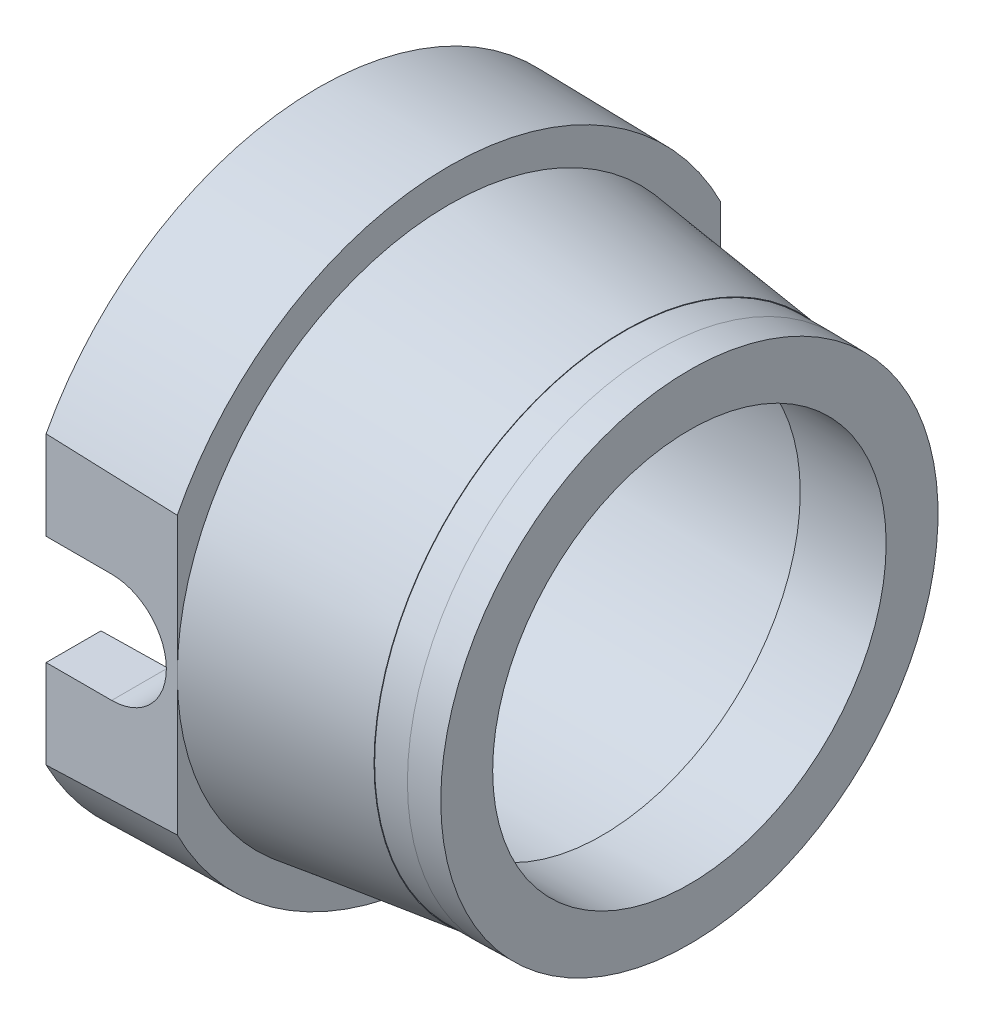
ISO-10303-21;
HEADER;
FILE_DESCRIPTION(('STEP AP214'),'2;1');
FILE_NAME('part.step','',(''),(''),'','','');
FILE_SCHEMA(('AUTOMOTIVE_DESIGN { 1 0 10303 214 1 1 1 1 }'));
ENDSEC;
DATA;
#1=APPLICATION_CONTEXT('core data for automotive mechanical design processes');
#2=APPLICATION_PROTOCOL_DEFINITION('international standard','automotive_design',2000,#1);
#3=PRODUCT_CONTEXT('',#1,'mechanical');
#4=PRODUCT('Part','Part','',(#3));
#5=PRODUCT_RELATED_PRODUCT_CATEGORY('part','',(#4));
#6=PRODUCT_DEFINITION_FORMATION('','',#4);
#7=PRODUCT_DEFINITION_CONTEXT('part definition',#1,'design');
#8=PRODUCT_DEFINITION('design','',#6,#7);
#9=PRODUCT_DEFINITION_SHAPE('','',#8);
#10=(LENGTH_UNIT() NAMED_UNIT(*) SI_UNIT(.MILLI.,.METRE.));
#11=(NAMED_UNIT(*) PLANE_ANGLE_UNIT() SI_UNIT($,.RADIAN.));
#12=(NAMED_UNIT(*) SI_UNIT($,.STERADIAN.) SOLID_ANGLE_UNIT());
#13=UNCERTAINTY_MEASURE_WITH_UNIT(LENGTH_MEASURE(1.E-05),#10,'distance_accuracy_value','');
#14=(GEOMETRIC_REPRESENTATION_CONTEXT(3) GLOBAL_UNCERTAINTY_ASSIGNED_CONTEXT((#13)) GLOBAL_UNIT_ASSIGNED_CONTEXT((#10,
#11,#12)) REPRESENTATION_CONTEXT('',''));
#15=CARTESIAN_POINT('',(0.,0.,0.));
#16=DIRECTION('',(0.,0.,1.));
#17=DIRECTION('',(1.,0.,0.));
#18=AXIS2_PLACEMENT_3D('',#15,#16,#17);
#19=CARTESIAN_POINT('',(0.,0.,0.));
#20=DIRECTION('',(-1.,0.,0.));
#21=DIRECTION('',(0.,0.,1.));
#22=AXIS2_PLACEMENT_3D('',#19,#20,#21);
#23=CONICAL_SURFACE('',#22,7.02618259743537,0.0174532925486288);
#24=CARTESIAN_POINT('',(-12.1872676926707,-3.71415595830881,6.21344466334053));
#25=CARTESIAN_POINT('',(-9.89562583112762,-3.63613958595245,6.21344466334053));
#26=CARTESIAN_POINT('',(-7.60404013963435,-3.55642084850198,6.21344466334053));
#27=CARTESIAN_POINT('',(-3.02104216778577,-3.39254531251143,6.21344466334053));
#28=CARTESIAN_POINT('',(-0.729629886433391,-3.30838854179676,6.21344466334053));
#29=CARTESIAN_POINT('',(3.85299535221891,-3.13460241250244,6.21344466334053));
#30=CARTESIAN_POINT('',(6.14420830894196,-3.04497303857963,6.21344466334053));
#31=CARTESIAN_POINT('',(9.58081722448607,-2.90517683479167,6.21344466334053));
#32=CARTESIAN_POINT('',(10.7263220416108,-2.85768591876728,6.21344466334053));
#33=CARTESIAN_POINT('',(13.0172439594786,-2.76061236810268,6.21344466334053));
#34=CARTESIAN_POINT('',(14.1626610601437,-2.71102973162117,6.21344466334053));
#35=CARTESIAN_POINT('',(15.3080257226916,-2.66024740322928,6.21344466334053));
#36=B_SPLINE_CURVE_WITH_KNOTS('',3,(#24,#25,#26,#27,#28,#29,#30,#31,#32,#33,#34,#35),
.UNSPECIFIED.,.F.,.F.,(4,2,2,2,2,4),(0.,6.87891030293197,13.7577774818794,20.6366639475237,
24.076128792137,27.5155966645013),.UNSPECIFIED.);
#37=CARTESIAN_POINT('',(0.,-3.28029683231696,6.21344466334053));
#38=VERTEX_POINT('',#37);
#39=CARTESIAN_POINT('',(3.,-3.16658089742208,6.21344466334053));
#40=VERTEX_POINT('',#39);
#41=EDGE_CURVE('E187',#38,#40,#36,.T.);
#42=ORIENTED_EDGE('',*,*,#41,.F.);
#43=CARTESIAN_POINT('',(0.,0.,0.));
#44=DIRECTION('',(-1.,0.,0.));
#45=DIRECTION('',(0.,0.,1.));
#46=AXIS2_PLACEMENT_3D('',#43,#44,#45);
#47=CIRCLE('',#46,7.02618259743537);
#48=CARTESIAN_POINT('',(0.,-3.28029683231696,-6.21344466334053));
#49=VERTEX_POINT('',#48);
#50=EDGE_CURVE('E144',#49,#38,#47,.T.);
#51=ORIENTED_EDGE('',*,*,#50,.F.);
#52=CARTESIAN_POINT('',(15.2414187475127,-2.66319994959127,-6.21344466334053));
#53=CARTESIAN_POINT('',(14.0958549741051,-2.71394359523572,-6.21344466334053));
#54=CARTESIAN_POINT('',(12.950238961195,-2.76349102414679,-6.21344466334053));
#55=CARTESIAN_POINT('',(10.6589195261381,-2.86049979818555,-6.21344466334053));
#56=CARTESIAN_POINT('',(9.51321610406869,-2.90796114513727,-6.21344466334053));
#57=CARTESIAN_POINT('',(6.07601165501921,-3.04767513380552,-6.21344466334053));
#58=CARTESIAN_POINT('',(3.78440211553146,-3.13725835039602,-6.21344466334053));
#59=CARTESIAN_POINT('',(-0.799015776381931,-3.31096342266905,-6.21344466334053));
#60=CARTESIAN_POINT('',(-3.09082412823569,-3.39508529357142,-6.21344466334053));
#61=CARTESIAN_POINT('',(-7.67461379683191,-3.55889915276708,-6.21344466334053));
#62=CARTESIAN_POINT('',(-9.96659511456438,-3.63859111341648,-6.21344466334053));
#63=CARTESIAN_POINT('',(-12.2586324979751,-3.71658320660326,-6.21344466334053));
#64=B_SPLINE_CURVE_WITH_KNOTS('',3,(#52,#53,#54,#55,#56,#57,#58,#59,#60,#61,#62,#63),
.UNSPECIFIED.,.F.,.F.,(4,2,2,2,2,4),(0.,3.44005949276843,6.88011597756067,13.7601859172206,
20.6402366824876,27.520330376414),.UNSPECIFIED.);
#65=CARTESIAN_POINT('',(3.,-3.16658089742208,-6.21344466334053));
#66=VERTEX_POINT('',#65);
#67=EDGE_CURVE('E197',#66,#49,#64,.T.);
#68=ORIENTED_EDGE('',*,*,#67,.F.);
#69=CARTESIAN_POINT('',(3.,0.,0.));
#70=DIRECTION('',(-1.,0.,0.));
#71=DIRECTION('',(0.,0.,1.));
#72=AXIS2_PLACEMENT_3D('',#69,#70,#71);
#73=CIRCLE('',#72,6.97381740256463);
#74=EDGE_CURVE('E176',#66,#40,#73,.T.);
#75=ORIENTED_EDGE('',*,*,#74,.T.);
#76=EDGE_LOOP('',(#42,#51,#68,#75));
#77=FACE_BOUND('',#76,.T.);
#78=ADVANCED_FACE('F49',(#77),#23,.T.);
#79=CARTESIAN_POINT('',(3.,0.,0.));
#80=DIRECTION('',(-1.,0.,0.));
#81=DIRECTION('',(0.,0.,1.));
#82=AXIS2_PLACEMENT_3D('',#79,#80,#81);
#83=PLANE('',#82);
#84=CARTESIAN_POINT('',(3.,3.16658089742208,6.21344466334053));
#85=VERTEX_POINT('',#84);
#86=CARTESIAN_POINT('',(3.,3.16658089742208,-6.21344466334053));
#87=VERTEX_POINT('',#86);
#88=EDGE_CURVE('E175',#85,#87,#73,.T.);
#89=ORIENTED_EDGE('',*,*,#88,.F.);
#90=DIRECTION('',(0.,1.,0.));
#91=VECTOR('',#90,1.);
#92=CARTESIAN_POINT('',(3.,5.95032536714044,6.21344466334053));
#93=LINE('',#92,#91);
#94=CARTESIAN_POINT('',(3.,0.,6.21344466334053));
#95=VERTEX_POINT('',#94);
#96=EDGE_CURVE('E352',#95,#85,#93,.T.);
#97=ORIENTED_EDGE('',*,*,#96,.F.);
#98=CARTESIAN_POINT('',(3.,0.,0.));
#99=DIRECTION('',(-1.,0.,0.));
#100=DIRECTION('',(0.,0.,1.));
#101=AXIS2_PLACEMENT_3D('',#98,#99,#100);
#102=CIRCLE('',#101,6.21344466334053);
#103=CARTESIAN_POINT('',(3.,0.,-6.21344466334053));
#104=VERTEX_POINT('',#103);
#105=EDGE_CURVE('E171',#95,#104,#102,.T.);
#106=ORIENTED_EDGE('',*,*,#105,.T.);
#107=DIRECTION('',(0.,-1.,0.));
#108=VECTOR('',#107,1.);
#109=CARTESIAN_POINT('',(3.,5.95032536714044,-6.21344466334053));
#110=LINE('',#109,#108);
#111=EDGE_CURVE('E199',#87,#104,#110,.T.);
#112=ORIENTED_EDGE('',*,*,#111,.F.);
#113=EDGE_LOOP('',(#89,#97,#106,#112));
#114=FACE_BOUND('',#113,.T.);
#115=ADVANCED_FACE('F252',(#114),#83,.F.);
#116=CARTESIAN_POINT('',(15.215736413473,2.66433765465463,6.21344466334053));
#117=CARTESIAN_POINT('',(14.070095868978,2.71506642254333,6.21344466334053));
#118=CARTESIAN_POINT('',(12.9244031612454,2.76460030895749,6.21344466334053));
#119=CARTESIAN_POINT('',(10.6329304545743,2.86158416491953,6.21344466334053));
#120=CARTESIAN_POINT('',(9.48715045571292,2.90903413628481,6.21344466334053));
#121=CARTESIAN_POINT('',(6.04971638440036,3.04871649396895,6.21344466334053));
#122=CARTESIAN_POINT('',(3.75795393230507,3.13828194963874,6.21344466334053));
#123=CARTESIAN_POINT('',(-0.825769587859922,3.31195582973247,6.21344466334053));
#124=CARTESIAN_POINT('',(-3.11773065535965,3.39606426932899,6.21344466334053));
#125=CARTESIAN_POINT('',(-7.70182558445647,3.55985439070571,6.21344466334053));
#126=CARTESIAN_POINT('',(-9.99395944704085,3.63953604491158,6.21344466334053));
#127=CARTESIAN_POINT('',(-12.2861493351395,3.71751879300665,6.21344466334053));
#128=B_SPLINE_CURVE_WITH_KNOTS('',3,(#116,#117,#118,#119,#120,#121,#122,#123,#124,#125,#126,
#127),.UNSPECIFIED.,.F.,.F.,(4,2,2,2,2,4),(0.,3.44028761006639,6.88057221973697,
13.7610984835044,20.6416056159538,27.5221556020752),.UNSPECIFIED.);
#129=CARTESIAN_POINT('',(0.,3.28029683231696,6.21344466334053));
#130=VERTEX_POINT('',#129);
#131=EDGE_CURVE('E72',#85,#130,#128,.T.);
#132=ORIENTED_EDGE('',*,*,#131,.F.);
#133=ORIENTED_EDGE('',*,*,#88,.T.);
#134=CARTESIAN_POINT('',(-12.1732282757239,3.71367831435299,-6.21344466334053));
#135=CARTESIAN_POINT('',(-9.88166422446232,3.63565715834759,-6.21344466334053));
#136=CARTESIAN_POINT('',(-7.59015636381853,3.55593314515168,-6.21344466334053));
#137=CARTESIAN_POINT('',(-3.00731414129191,3.39204545643078,-6.21344466334053));
#138=CARTESIAN_POINT('',(-0.715979778410619,3.30788180876708,-6.21344466334053));
#139=CARTESIAN_POINT('',(3.86648952227814,3.13407970604902,-6.21344466334053));
#140=CARTESIAN_POINT('',(6.15762445950775,3.04444123562709,-6.21344466334053));
#141=CARTESIAN_POINT('',(9.59411621570703,2.90462882716021,-6.21344466334053));
#142=CARTESIAN_POINT('',(10.739581961215,2.85713208275401,-6.21344466334053));
#143=CARTESIAN_POINT('',(13.0304256751926,2.76004576290605,-6.21344466334053));
#144=CARTESIAN_POINT('',(14.1758036435839,2.71045618561957,-6.21344466334053));
#145=CARTESIAN_POINT('',(15.3211291346448,2.65966623068114,-6.21344466334053));
#146=B_SPLINE_CURVE_WITH_KNOTS('',3,(#134,#135,#136,#137,#138,#139,#140,#141,#142,#143,#144,
#145),.UNSPECIFIED.,.F.,.F.,(4,2,2,2,2,4),(0.,6.87867749758971,13.7573118326248,
20.6359654765506,24.0753139294242,27.5146654139589),.UNSPECIFIED.);
#147=CARTESIAN_POINT('',(0.,3.28029683231696,-6.21344466334053));
#148=VERTEX_POINT('',#147);
#149=EDGE_CURVE('E198',#148,#87,#146,.T.);
#150=ORIENTED_EDGE('',*,*,#149,.F.);
#151=EDGE_CURVE('E150',#130,#148,#47,.T.);
#152=ORIENTED_EDGE('',*,*,#151,.F.);
#153=EDGE_LOOP('',(#132,#133,#150,#152));
#154=FACE_BOUND('',#153,.T.);
#155=ADVANCED_FACE('F51',(#154),#23,.T.);
#156=EDGE_CURVE('E172',#104,#95,#102,.T.);
#157=ORIENTED_EDGE('',*,*,#156,.T.);
#158=EDGE_CURVE('E354',#40,#95,#93,.T.);
#159=ORIENTED_EDGE('',*,*,#158,.F.);
#160=ORIENTED_EDGE('',*,*,#74,.F.);
#161=EDGE_CURVE('E193',#104,#66,#110,.T.);
#162=ORIENTED_EDGE('',*,*,#161,.F.);
#163=EDGE_LOOP('',(#157,#159,#160,#162));
#164=FACE_BOUND('',#163,.T.);
#165=ADVANCED_FACE('F248',(#164),#83,.F.);
#166=CARTESIAN_POINT('',(7.00000000000001,0.,0.));
#167=DIRECTION('',(-1.,0.,0.));
#168=DIRECTION('',(0.,0.,1.));
#169=AXIS2_PLACEMENT_3D('',#166,#167,#168);
#170=CONICAL_SURFACE('',#169,5.7130912986959,0.124441975667188);
#171=ORIENTED_EDGE('',*,*,#156,.F.);
#172=ORIENTED_EDGE('',*,*,#105,.F.);
#173=EDGE_LOOP('',(#171,#172));
#174=FACE_BOUND('',#173,.T.);
#175=CARTESIAN_POINT('',(7.00000000000001,0.,0.));
#176=DIRECTION('',(-1.,0.,0.));
#177=DIRECTION('',(0.,0.,1.));
#178=AXIS2_PLACEMENT_3D('',#175,#176,#177);
#179=CIRCLE('',#178,5.7130912986959);
#180=CARTESIAN_POINT('',(7.00000000000001,0.,5.7130912986959));
#181=VERTEX_POINT('',#180);
#182=EDGE_CURVE('E168',#181,#181,#179,.T.);
#183=ORIENTED_EDGE('',*,*,#182,.T.);
#184=EDGE_LOOP('',(#183));
#185=FACE_BOUND('',#184,.T.);
#186=ADVANCED_FACE('F245',(#174,#185),#170,.T.);
#187=CARTESIAN_POINT('',(7.,0.,0.));
#188=DIRECTION('',(-1.,0.,0.));
#189=DIRECTION('',(0.,0.,1.));
#190=AXIS2_PLACEMENT_3D('',#187,#188,#189);
#191=PLANE('',#190);
#192=ORIENTED_EDGE('',*,*,#182,.F.);
#193=EDGE_LOOP('',(#192));
#194=FACE_BOUND('',#193,.T.);
#195=CARTESIAN_POINT('',(7.00000000000001,0.,0.));
#196=DIRECTION('',(-1.,0.,0.));
#197=DIRECTION('',(0.,0.,1.));
#198=AXIS2_PLACEMENT_3D('',#195,#196,#197);
#199=CIRCLE('',#198,5.7);
#200=CARTESIAN_POINT('',(7.00000000000001,0.,5.7));
#201=VERTEX_POINT('',#200);
#202=EDGE_CURVE('E165',#201,#201,#199,.T.);
#203=ORIENTED_EDGE('',*,*,#202,.T.);
#204=EDGE_LOOP('',(#203));
#205=FACE_BOUND('',#204,.T.);
#206=ADVANCED_FACE('F241',(#194,#205),#191,.F.);
#207=CARTESIAN_POINT('',(-162.804450562965,0.,0.));
#208=DIRECTION('',(-1.,0.,0.));
#209=DIRECTION('',(0.,0.,1.));
#210=AXIS2_PLACEMENT_3D('',#207,#208,#209);
#211=CYLINDRICAL_SURFACE('',#210,5.7);
#212=CARTESIAN_POINT('',(7.75000000000006,0.,0.));
#213=DIRECTION('',(-1.,0.,0.));
#214=DIRECTION('',(0.,0.,1.));
#215=AXIS2_PLACEMENT_3D('',#212,#213,#214);
#216=CIRCLE('',#215,5.7);
#217=CARTESIAN_POINT('',(7.75000000000006,0.,5.7));
#218=VERTEX_POINT('',#217);
#219=EDGE_CURVE('E162',#218,#218,#216,.T.);
#220=ORIENTED_EDGE('',*,*,#219,.T.);
#221=EDGE_LOOP('',(#220));
#222=FACE_BOUND('',#221,.T.);
#223=ORIENTED_EDGE('',*,*,#202,.F.);
#224=EDGE_LOOP('',(#223));
#225=FACE_BOUND('',#224,.T.);
#226=ADVANCED_FACE('F237',(#222,#225),#211,.T.);
#227=CARTESIAN_POINT('',(7.75000000000006,0.,0.));
#228=DIRECTION('',(-1.,0.,0.));
#229=DIRECTION('',(0.,0.,1.));
#230=AXIS2_PLACEMENT_3D('',#227,#228,#229);
#231=CONICAL_SURFACE('',#230,5.7,0.0174532925195895);
#232=CARTESIAN_POINT('',(8.50000000000001,0.,0.));
#233=DIRECTION('',(-1.,0.,0.));
#234=DIRECTION('',(0.,0.,1.));
#235=AXIS2_PLACEMENT_3D('',#232,#233,#234);
#236=CIRCLE('',#235,5.6869087013041);
#237=CARTESIAN_POINT('',(8.50000000000001,0.,5.6869087013041));
#238=VERTEX_POINT('',#237);
#239=EDGE_CURVE('E159',#238,#238,#236,.T.);
#240=ORIENTED_EDGE('',*,*,#239,.T.);
#241=EDGE_LOOP('',(#240));
#242=FACE_BOUND('',#241,.T.);
#243=ORIENTED_EDGE('',*,*,#219,.F.);
#244=EDGE_LOOP('',(#243));
#245=FACE_BOUND('',#244,.T.);
#246=ADVANCED_FACE('F233',(#242,#245),#231,.T.);
#247=CARTESIAN_POINT('',(8.5,0.,0.));
#248=DIRECTION('',(-1.,0.,0.));
#249=DIRECTION('',(0.,0.,1.));
#250=AXIS2_PLACEMENT_3D('',#247,#248,#249);
#251=PLANE('',#250);
#252=ORIENTED_EDGE('',*,*,#239,.F.);
#253=EDGE_LOOP('',(#252));
#254=FACE_BOUND('',#253,.T.);
#255=CARTESIAN_POINT('',(8.50000000000001,0.,0.));
#256=DIRECTION('',(-1.,0.,0.));
#257=DIRECTION('',(0.,0.,1.));
#258=AXIS2_PLACEMENT_3D('',#255,#256,#257);
#259=CIRCLE('',#258,4.5);
#260=CARTESIAN_POINT('',(8.50000000000001,0.,4.5));
#261=VERTEX_POINT('',#260);
#262=EDGE_CURVE('E156',#261,#261,#259,.T.);
#263=ORIENTED_EDGE('',*,*,#262,.T.);
#264=EDGE_LOOP('',(#263));
#265=FACE_BOUND('',#264,.T.);
#266=ADVANCED_FACE('F229',(#254,#265),#251,.F.);
#267=CARTESIAN_POINT('',(6.50000000000001,0.,0.));
#268=DIRECTION('',(-1.,0.,0.));
#269=DIRECTION('',(0.,0.,1.));
#270=AXIS2_PLACEMENT_3D('',#267,#268,#269);
#271=CONICAL_SURFACE('',#270,4.53491012984761,0.0174532925155321);
#272=ORIENTED_EDGE('',*,*,#262,.F.);
#273=EDGE_LOOP('',(#272));
#274=FACE_BOUND('',#273,.T.);
#275=CARTESIAN_POINT('',(6.50000000000001,0.,0.));
#276=DIRECTION('',(-1.,0.,0.));
#277=DIRECTION('',(0.,0.,1.));
#278=AXIS2_PLACEMENT_3D('',#275,#276,#277);
#279=CIRCLE('',#278,4.53491012984761);
#280=CARTESIAN_POINT('',(6.50000000000001,0.,4.53491012984761));
#281=VERTEX_POINT('',#280);
#282=EDGE_CURVE('E147',#281,#281,#279,.T.);
#283=ORIENTED_EDGE('',*,*,#282,.T.);
#284=EDGE_LOOP('',(#283));
#285=FACE_BOUND('',#284,.T.);
#286=ADVANCED_FACE('F225',(#274,#285),#271,.F.);
#287=CARTESIAN_POINT('',(6.5,0.,0.));
#288=DIRECTION('',(-1.,0.,0.));
#289=DIRECTION('',(0.,0.,1.));
#290=AXIS2_PLACEMENT_3D('',#287,#288,#289);
#291=PLANE('',#290);
#292=CARTESIAN_POINT('',(6.50000000000001,0.,0.));
#293=DIRECTION('',(-1.,0.,0.));
#294=DIRECTION('',(0.,0.,1.));
#295=AXIS2_PLACEMENT_3D('',#292,#293,#294);
#296=CIRCLE('',#295,5.);
#297=CARTESIAN_POINT('',(6.50000000000001,0.,5.));
#298=VERTEX_POINT('',#297);
#299=EDGE_CURVE('E143',#298,#298,#296,.T.);
#300=ORIENTED_EDGE('',*,*,#299,.T.);
#301=EDGE_LOOP('',(#300));
#302=FACE_BOUND('',#301,.T.);
#303=ORIENTED_EDGE('',*,*,#282,.F.);
#304=EDGE_LOOP('',(#303));
#305=FACE_BOUND('',#304,.T.);
#306=ADVANCED_FACE('F221',(#302,#305),#291,.T.);
#307=CARTESIAN_POINT('',(0.,0.,0.));
#308=DIRECTION('',(-1.,0.,0.));
#309=DIRECTION('',(0.,0.,1.));
#310=AXIS2_PLACEMENT_3D('',#307,#308,#309);
#311=CONICAL_SURFACE('',#310,5.11345792204792,0.0174532925221742);
#312=ORIENTED_EDGE('',*,*,#299,.F.);
#313=EDGE_LOOP('',(#312));
#314=FACE_BOUND('',#313,.T.);
#315=CARTESIAN_POINT('',(0.,0.,0.));
#316=DIRECTION('',(-1.,0.,0.));
#317=DIRECTION('',(0.,0.,1.));
#318=AXIS2_PLACEMENT_3D('',#315,#316,#317);
#319=CIRCLE('',#318,5.11345792204792);
#320=CARTESIAN_POINT('',(0.,1.25,4.95832148217061));
#321=VERTEX_POINT('',#320);
#322=CARTESIAN_POINT('',(0.,-1.25,4.95832148217062));
#323=VERTEX_POINT('',#322);
#324=EDGE_CURVE('E135',#321,#323,#319,.T.);
#325=ORIENTED_EDGE('',*,*,#324,.T.);
#326=CARTESIAN_POINT('',(10.7937824960402,-1.25,4.76378365565247));
#327=CARTESIAN_POINT('',(7.45263925658351,-1.25,4.82407282105725));
#328=CARTESIAN_POINT('',(4.11149482854553,-1.25,4.88429597229728));
#329=CARTESIAN_POINT('',(-2.57079640459779,-1.25,5.00461024644609));
#330=CARTESIAN_POINT('',(-5.91194320970313,-1.25,5.06470136935488));
#331=CARTESIAN_POINT('',(-9.25309120338977,-1.25,5.12472647809891));
#332=B_SPLINE_CURVE_WITH_KNOTS('',3,(#326,#327,#328,#329,#330,#331),.UNSPECIFIED.,.F.,.F.,(4,2,
4),(0.,10.0250614089187,20.0501228175517),.UNSPECIFIED.);
#333=CARTESIAN_POINT('',(1.5,-1.25,4.93131526357985));
#334=VERTEX_POINT('',#333);
#335=EDGE_CURVE('E355',#334,#323,#332,.T.);
#336=ORIENTED_EDGE('',*,*,#335,.F.);
#337=CARTESIAN_POINT('',(0.632272888729511,-0.899749776530492,5.02246514097743));
#338=CARTESIAN_POINT('',(0.581971045113393,-0.851236051551845,5.03204749858372));
#339=CARTESIAN_POINT('',(0.535723226377663,-0.798477111263344,5.04158667667561));
#340=CARTESIAN_POINT('',(0.452604464527375,-0.685832332072037,5.05960508913843));
#341=CARTESIAN_POINT('',(0.41573813807103,-0.625943005482781,5.06808380061127));
#342=CARTESIAN_POINT('',(0.352452545345354,-0.500568057419742,5.08310817793569));
#343=CARTESIAN_POINT('',(0.32604317349519,-0.43507720665221,5.08965201152151));
#344=CARTESIAN_POINT('',(0.284590253278495,-0.300400447627443,5.10009694315012));
#345=CARTESIAN_POINT('',(0.269543507736162,-0.231215584649237,5.10399878455541));
#346=CARTESIAN_POINT('',(0.251528529239784,-0.092695547794061,5.10868644259326));
#347=CARTESIAN_POINT('',(0.248308732560224,-0.0233952674947023,5.10953714865691));
#348=CARTESIAN_POINT('',(0.253361063232631,0.114752756639064,5.10821360850052));
#349=CARTESIAN_POINT('',(0.261632491285717,0.183600527754767,5.10603954635284));
#350=CARTESIAN_POINT('',(0.289167056983962,0.317815658034504,5.09895113250515));
#351=CARTESIAN_POINT('',(0.308262113049407,0.383219900933175,5.09407870999745));
#352=CARTESIAN_POINT('',(0.35671063398506,0.509891362122939,5.08211331564021));
#353=CARTESIAN_POINT('',(0.386065144823517,0.571158157834272,5.07502011738662));
#354=CARTESIAN_POINT('',(0.454843144943429,0.689129395847666,5.05915356827497));
#355=CARTESIAN_POINT('',(0.494450878406014,0.74572230597306,5.05035029931115));
#356=CARTESIAN_POINT('',(0.582359929546551,0.85157019455137,5.0320289562338));
#357=CARTESIAN_POINT('',(0.630662852038793,0.900823815367262,5.02251075035833));
#358=CARTESIAN_POINT('',(0.736151723322787,0.99198067148495,5.00343986149311));
#359=CARTESIAN_POINT('',(0.793544000504375,1.03364681992662,4.99389331724193));
#360=CARTESIAN_POINT('',(0.91468622070282,1.10675754341993,4.97603589540081));
#361=CARTESIAN_POINT('',(0.978436031979168,1.13820233022063,4.96772499221486));
#362=CARTESIAN_POINT('',(1.11032248975478,1.18980949132651,4.95325092519918));
#363=CARTESIAN_POINT('',(1.17844260196757,1.21001188190666,4.94708017364376));
#364=CARTESIAN_POINT('',(1.31730238289377,1.23860545872603,4.9375007646643));
#365=CARTESIAN_POINT('',(1.38804146406836,1.24699927781534,4.93409149161037));
#366=CARTESIAN_POINT('',(1.52792674019352,1.25158889734342,4.9304099114145));
#367=CARTESIAN_POINT('',(1.59705936104572,1.24813266590078,4.93004917702619));
#368=CARTESIAN_POINT('',(1.73376237022013,1.2298820600756,4.93217425939793));
#369=CARTESIAN_POINT('',(1.80133282378158,1.21508816006112,4.93465995706541));
#370=CARTESIAN_POINT('',(1.93235352157917,1.17482915120581,4.9420469161081));
#371=CARTESIAN_POINT('',(1.99583705631331,1.14946770886033,4.9469247905848));
#372=CARTESIAN_POINT('',(2.11770857234733,1.08883882360647,4.95844329300216));
#373=CARTESIAN_POINT('',(2.17609586877843,1.05357005195897,4.96508415738278));
#374=CARTESIAN_POINT('',(2.2875459740965,0.973189657568957,4.97948728701782));
#375=CARTESIAN_POINT('',(2.34045810846053,0.927873062878678,4.98727155753299));
#376=CARTESIAN_POINT('',(2.43803791205185,0.829099306072305,5.00291262678888));
#377=CARTESIAN_POINT('',(2.48270458429486,0.775641160960525,5.01076943417982));
#378=CARTESIAN_POINT('',(2.56332041054327,0.660946196974652,5.02577560770861));
#379=CARTESIAN_POINT('',(2.59909820848263,0.599586700138108,5.0329096972967));
#380=CARTESIAN_POINT('',(2.65980824112373,0.471553651174997,5.04545038380659));
#381=CARTESIAN_POINT('',(2.68474157171332,0.40488063681213,5.05085715526789));
#382=CARTESIAN_POINT('',(2.72271540080092,0.269027224407031,5.05923579495152));
#383=CARTESIAN_POINT('',(2.73590783258897,0.199891272408041,5.06223871742726));
#384=CARTESIAN_POINT('',(2.75051263930218,0.0603264006438176,5.06556891608811));
#385=CARTESIAN_POINT('',(2.75192667132672,-0.0101023358426183,5.06589656865599));
#386=CARTESIAN_POINT('',(2.74302581570782,-0.148687426746614,5.0638601382588));
#387=CARTESIAN_POINT('',(2.73295558619224,-0.216860501827541,5.06155220188668));
#388=CARTESIAN_POINT('',(2.70180984915263,-0.350517039933227,5.05460089983842));
#389=CARTESIAN_POINT('',(2.68073399774705,-0.416000418846798,5.04995746118736));
#390=CARTESIAN_POINT('',(2.6280996298618,-0.542794339693835,5.03883493015218));
#391=CARTESIAN_POINT('',(2.59649275579539,-0.604084029985776,5.03234739037387));
#392=CARTESIAN_POINT('',(2.52372192128124,-0.720562988497308,5.01827803368671));
#393=CARTESIAN_POINT('',(2.48255650702226,-0.775751326841822,5.01069605038433));
#394=CARTESIAN_POINT('',(2.39071035118451,-0.879807112668143,4.99511741709311));
#395=CARTESIAN_POINT('',(2.33983233425838,-0.928499753263586,4.98711523892129));
#396=CARTESIAN_POINT('',(2.23056379188108,-1.01671386148773,4.97182946534413));
#397=CARTESIAN_POINT('',(2.17217292206307,-1.05623490848489,4.96454590290504));
#398=CARTESIAN_POINT('',(2.04913267489855,-1.12514372604089,4.95158848536935));
#399=CARTESIAN_POINT('',(1.98445386118392,-1.15448057693593,4.94592274348471));
#400=CARTESIAN_POINT('',(1.85091838810306,-1.20182016916719,4.93703331187429));
#401=CARTESIAN_POINT('',(1.78206261158882,-1.21982529651311,4.93380910802876));
#402=CARTESIAN_POINT('',(1.64389604643996,-1.24361986629601,4.93035207316571));
#403=CARTESIAN_POINT('',(1.57463547499216,-1.24969101310835,4.93004958148589));
#404=CARTESIAN_POINT('',(1.43611219164941,-1.25028588431508,4.93239326815826));
#405=CARTESIAN_POINT('',(1.36684947974137,-1.24480951171024,4.93503947127941));
#406=CARTESIAN_POINT('',(1.23136662134896,-1.22269341412803,4.94300037158662));
#407=CARTESIAN_POINT('',(1.16511650733955,-1.20622135839523,4.94827469174536));
#408=CARTESIAN_POINT('',(1.03637562335488,-1.16282595728433,4.96095918017884));
#409=CARTESIAN_POINT('',(0.973883549153543,-1.13590626221385,4.96836860223632));
#410=CARTESIAN_POINT('',(0.862565186162727,-1.07683772860304,4.98346375494515));
#411=CARTESIAN_POINT('',(0.813046657256578,-1.04593549513193,4.99096798764975));
#412=CARTESIAN_POINT('',(0.718839477073816,-0.977586601984068,5.00647981000042));
#413=CARTESIAN_POINT('',(0.674151212457714,-0.940139419014009,5.01448743986218));
#414=CARTESIAN_POINT('',(0.632272888729511,-0.899749776530492,5.02246514097743));
#415=B_SPLINE_CURVE_WITH_KNOTS('',3,(#337,#338,#339,#340,#341,#342,#343,#344,#345,#346,#347,
#348,#349,#350,#351,#352,#353,#354,#355,#356,#357,#358,#359,#360,#361,#362,#363,#364,#365,#366,
#367,#368,#369,#370,#371,#372,#373,#374,#375,#376,#377,#378,#379,#380,#381,#382,#383,#384,#385,
#386,#387,#388,#389,#390,#391,#392,#393,#394,#395,#396,#397,#398,#399,#400,#401,#402,#403,#404,
#405,#406,#407,#408,#409,#410,#411,#412,#413,#414),.UNSPECIFIED.,.T.,.F.,(4,2,2,2,2,2,2,2,2,2,2,
2,2,2,2,2,2,2,2,2,2,2,2,2,2,2,2,2,2,2,2,2,2,2,2,2,2,2,4),(0.,0.211410375232638,
0.422924585781003,0.634638456521407,0.846292733738429,1.05341808395253,1.26053083009835,
1.46451210589547,1.66851418398767,1.87647284843605,2.08446993388314,2.29813939514449,
2.51180442967744,2.72470399754832,2.93755608960617,3.14421211813054,3.35085950063863,
3.55552571883935,3.76021939933084,3.96955249620992,4.17891088764504,4.3920370962136,
4.60514176230219,4.81544686920225,5.02572238784279,5.23160060082621,5.43748524706332,
5.64432863607378,5.85120350567019,6.06284190822281,6.27449001510895,6.48718158851175,
6.69982836254318,6.90739223792832,7.11495785685828,7.31942855844969,7.52382788410833,
7.69982151293115,7.87582921954841),.UNSPECIFIED.);
#416=CARTESIAN_POINT('',(1.5,1.25,4.93131526357985));
#417=VERTEX_POINT('',#416);
#418=EDGE_CURVE('E137',#417,#334,#415,.T.);
#419=ORIENTED_EDGE('',*,*,#418,.F.);
#420=CARTESIAN_POINT('',(10.7937824960402,1.25,4.76378365565247));
#421=CARTESIAN_POINT('',(7.45263925658351,1.25,4.82407282105725));
#422=CARTESIAN_POINT('',(4.11149482854553,1.25,4.88429597229728));
#423=CARTESIAN_POINT('',(-2.57079640459779,1.25,5.00461024644609));
#424=CARTESIAN_POINT('',(-5.91194320970313,1.25,5.06470136935488));
#425=CARTESIAN_POINT('',(-9.25309120338977,1.25,5.12472647809891));
#426=B_SPLINE_CURVE_WITH_KNOTS('',3,(#420,#421,#422,#423,#424,#425),.UNSPECIFIED.,.F.,.F.,(4,2,
4),(0.,10.0250614089187,20.0501228175517),.UNSPECIFIED.);
#427=EDGE_CURVE('E124',#417,#321,#426,.T.);
#428=ORIENTED_EDGE('',*,*,#427,.T.);
#429=EDGE_LOOP('',(#325,#336,#419,#428));
#430=FACE_BOUND('',#429,.T.);
#431=ADVANCED_FACE('F133',(#314,#430),#311,.F.);
#432=CARTESIAN_POINT('',(0.,0.,0.));
#433=DIRECTION('',(-1.,0.,0.));
#434=DIRECTION('',(0.,0.,1.));
#435=AXIS2_PLACEMENT_3D('',#432,#433,#434);
#436=PLANE('',#435);
#437=DIRECTION('',(0.,0.,1.));
#438=VECTOR('',#437,1.);
#439=CARTESIAN_POINT('',(0.,-1.25,-6.21444466334053));
#440=LINE('',#439,#438);
#441=CARTESIAN_POINT('',(0.,-1.25,6.21344466334053));
#442=VERTEX_POINT('',#441);
#443=EDGE_CURVE('E138',#323,#442,#440,.T.);
#444=ORIENTED_EDGE('',*,*,#443,.F.);
#445=ORIENTED_EDGE('',*,*,#324,.F.);
#446=DIRECTION('',(0.,0.,1.));
#447=VECTOR('',#446,1.);
#448=CARTESIAN_POINT('',(0.,1.25,-6.21444466334053));
#449=LINE('',#448,#447);
#450=CARTESIAN_POINT('',(0.,1.25,6.21344466334053));
#451=VERTEX_POINT('',#450);
#452=EDGE_CURVE('E121',#321,#451,#449,.T.);
#453=ORIENTED_EDGE('',*,*,#452,.T.);
#454=DIRECTION('',(0.,-1.,0.));
#455=VECTOR('',#454,1.);
#456=CARTESIAN_POINT('',(0.,0.,6.21344466334053));
#457=LINE('',#456,#455);
#458=EDGE_CURVE('E12',#130,#451,#457,.T.);
#459=ORIENTED_EDGE('',*,*,#458,.F.);
#460=ORIENTED_EDGE('',*,*,#151,.T.);
#461=DIRECTION('',(0.,1.,0.));
#462=VECTOR('',#461,1.);
#463=CARTESIAN_POINT('',(0.,0.,-6.21344466334053));
#464=LINE('',#463,#462);
#465=EDGE_CURVE('E178',#49,#148,#464,.T.);
#466=ORIENTED_EDGE('',*,*,#465,.F.);
#467=ORIENTED_EDGE('',*,*,#50,.T.);
#468=EDGE_CURVE('E58',#442,#38,#457,.T.);
#469=ORIENTED_EDGE('',*,*,#468,.F.);
#470=EDGE_LOOP('',(#444,#445,#453,#459,#460,#466,#467,#469));
#471=FACE_BOUND('',#470,.T.);
#472=ADVANCED_FACE('F141',(#471),#436,.T.);
#473=CARTESIAN_POINT('',(0.,5.95032536714044,-6.21344466334053));
#474=DIRECTION('',(0.,0.,1.));
#475=DIRECTION('',(1.,0.,0.));
#476=AXIS2_PLACEMENT_3D('',#473,#474,#475);
#477=PLANE('',#476);
#478=ORIENTED_EDGE('',*,*,#67,.T.);
#479=ORIENTED_EDGE('',*,*,#465,.T.);
#480=ORIENTED_EDGE('',*,*,#149,.T.);
#481=ORIENTED_EDGE('',*,*,#111,.T.);
#482=ORIENTED_EDGE('',*,*,#161,.T.);
#483=EDGE_LOOP('',(#478,#479,#480,#481,#482));
#484=FACE_BOUND('',#483,.T.);
#485=ADVANCED_FACE('F209',(#484),#477,.F.);
#486=CARTESIAN_POINT('',(0.,5.95032536714044,6.21344466334053));
#487=DIRECTION('',(0.,0.,-1.));
#488=DIRECTION('',(-1.,0.,0.));
#489=AXIS2_PLACEMENT_3D('',#486,#487,#488);
#490=PLANE('',#489);
#491=CARTESIAN_POINT('',(1.5,0.,6.21344466334053));
#492=DIRECTION('',(0.,0.,1.));
#493=DIRECTION('',(1.,0.,0.));
#494=AXIS2_PLACEMENT_3D('',#491,#492,#493);
#495=CIRCLE('',#494,1.25);
#496=CARTESIAN_POINT('',(1.5,-1.25,6.21344466334053));
#497=VERTEX_POINT('',#496);
#498=CARTESIAN_POINT('',(1.5,1.25,6.21344466334053));
#499=VERTEX_POINT('',#498);
#500=EDGE_CURVE('E348',#497,#499,#495,.T.);
#501=ORIENTED_EDGE('',*,*,#500,.F.);
#502=DIRECTION('',(1.,0.,0.));
#503=VECTOR('',#502,1.);
#504=CARTESIAN_POINT('',(0.,-1.25,6.21344466334053));
#505=LINE('',#504,#503);
#506=EDGE_CURVE('E65',#442,#497,#505,.T.);
#507=ORIENTED_EDGE('',*,*,#506,.F.);
#508=ORIENTED_EDGE('',*,*,#468,.T.);
#509=ORIENTED_EDGE('',*,*,#41,.T.);
#510=ORIENTED_EDGE('',*,*,#158,.T.);
#511=ORIENTED_EDGE('',*,*,#96,.T.);
#512=ORIENTED_EDGE('',*,*,#131,.T.);
#513=ORIENTED_EDGE('',*,*,#458,.T.);
#514=DIRECTION('',(1.,0.,0.));
#515=VECTOR('',#514,1.);
#516=CARTESIAN_POINT('',(0.,1.25,6.21344466334053));
#517=LINE('',#516,#515);
#518=EDGE_CURVE('E127',#451,#499,#517,.T.);
#519=ORIENTED_EDGE('',*,*,#518,.T.);
#520=EDGE_LOOP('',(#501,#507,#508,#509,#510,#511,#512,#513,#519));
#521=FACE_BOUND('',#520,.T.);
#522=ADVANCED_FACE('F186',(#521),#490,.F.);
#523=CARTESIAN_POINT('',(0.,-1.25,-6.21444466334053));
#524=DIRECTION('',(0.,-1.,0.));
#525=DIRECTION('',(1.,0.,0.));
#526=AXIS2_PLACEMENT_3D('',#523,#524,#525);
#527=PLANE('',#526);
#528=ORIENTED_EDGE('',*,*,#335,.T.);
#529=ORIENTED_EDGE('',*,*,#443,.T.);
#530=ORIENTED_EDGE('',*,*,#506,.T.);
#531=DIRECTION('',(0.,0.,1.));
#532=VECTOR('',#531,1.);
#533=CARTESIAN_POINT('',(1.5,-1.25,-6.21444466334053));
#534=LINE('',#533,#532);
#535=EDGE_CURVE('E375',#334,#497,#534,.T.);
#536=ORIENTED_EDGE('',*,*,#535,.F.);
#537=EDGE_LOOP('',(#528,#529,#530,#536));
#538=FACE_BOUND('',#537,.T.);
#539=ADVANCED_FACE('F312',(#538),#527,.F.);
#540=CARTESIAN_POINT('',(0.,1.25,-6.21444466334053));
#541=DIRECTION('',(0.,-1.,0.));
#542=DIRECTION('',(1.,0.,0.));
#543=AXIS2_PLACEMENT_3D('',#540,#541,#542);
#544=PLANE('',#543);
#545=DIRECTION('',(0.,0.,1.));
#546=VECTOR('',#545,1.);
#547=CARTESIAN_POINT('',(1.5,1.25,-6.21444466334053));
#548=LINE('',#547,#546);
#549=EDGE_CURVE('E387',#417,#499,#548,.T.);
#550=ORIENTED_EDGE('',*,*,#549,.T.);
#551=ORIENTED_EDGE('',*,*,#518,.F.);
#552=ORIENTED_EDGE('',*,*,#452,.F.);
#553=ORIENTED_EDGE('',*,*,#427,.F.);
#554=EDGE_LOOP('',(#550,#551,#552,#553));
#555=FACE_BOUND('',#554,.T.);
#556=ADVANCED_FACE('F123',(#555),#544,.T.);
#557=CARTESIAN_POINT('',(1.5,0.,-6.21444466334053));
#558=DIRECTION('',(0.,0.,1.));
#559=DIRECTION('',(1.,0.,0.));
#560=AXIS2_PLACEMENT_3D('',#557,#558,#559);
#561=CYLINDRICAL_SURFACE('',#560,1.25);
#562=ORIENTED_EDGE('',*,*,#418,.T.);
#563=ORIENTED_EDGE('',*,*,#535,.T.);
#564=ORIENTED_EDGE('',*,*,#500,.T.);
#565=ORIENTED_EDGE('',*,*,#549,.F.);
#566=EDGE_LOOP('',(#562,#563,#564,#565));
#567=FACE_BOUND('',#566,.T.);
#568=ADVANCED_FACE('F328',(#567),#561,.F.);
#569=CLOSED_SHELL('',(#78,#115,#155,#165,#186,#206,#226,#246,#266,#286,#306,#431,#472,#485,#522,
#539,#556,#568));
#570=MANIFOLD_SOLID_BREP('B2',#569);
#571=ADVANCED_BREP_SHAPE_REPRESENTATION('',(#18,#570),#14);
#572=SHAPE_DEFINITION_REPRESENTATION(#9,#571);
ENDSEC;
END-ISO-10303-21;
